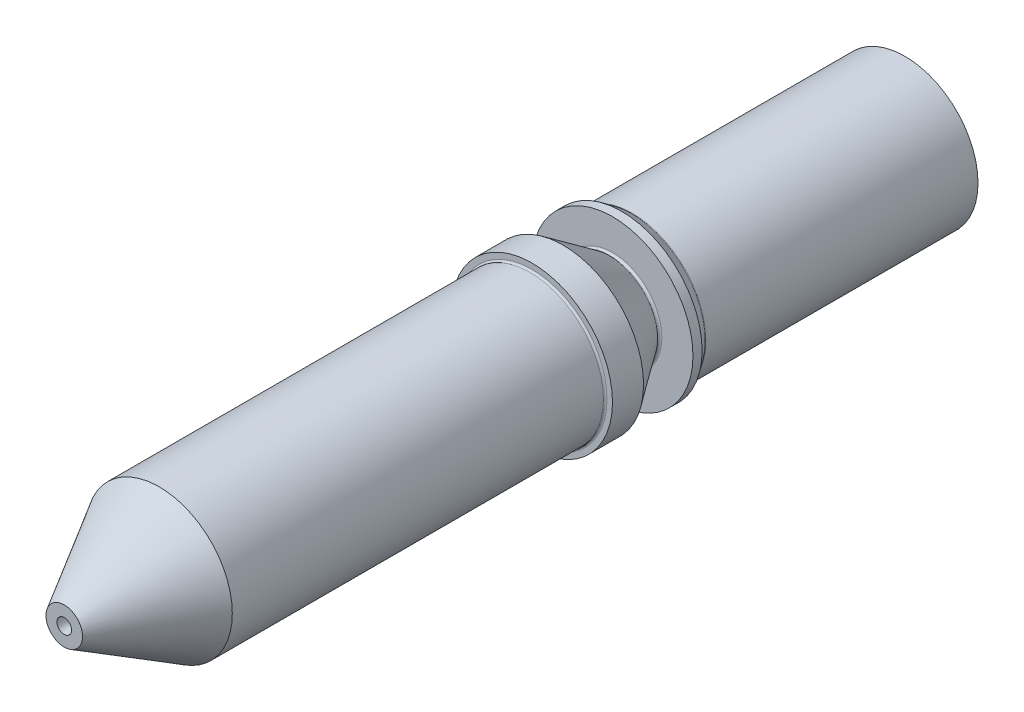
ISO-10303-21;
HEADER;
FILE_DESCRIPTION(('STEP AP214'),'2;1');
FILE_NAME('part.step','',(''),(''),'','','');
FILE_SCHEMA(('AUTOMOTIVE_DESIGN { 1 0 10303 214 1 1 1 1 }'));
ENDSEC;
DATA;
#1=APPLICATION_CONTEXT('core data for automotive mechanical design processes');
#2=APPLICATION_PROTOCOL_DEFINITION('international standard','automotive_design',2000,#1);
#3=PRODUCT_CONTEXT('',#1,'mechanical');
#4=PRODUCT('Part','Part','',(#3));
#5=PRODUCT_RELATED_PRODUCT_CATEGORY('part','',(#4));
#6=PRODUCT_DEFINITION_FORMATION('','',#4);
#7=PRODUCT_DEFINITION_CONTEXT('part definition',#1,'design');
#8=PRODUCT_DEFINITION('design','',#6,#7);
#9=PRODUCT_DEFINITION_SHAPE('','',#8);
#10=(LENGTH_UNIT() NAMED_UNIT(*) SI_UNIT(.MILLI.,.METRE.));
#11=(NAMED_UNIT(*) PLANE_ANGLE_UNIT() SI_UNIT($,.RADIAN.));
#12=(NAMED_UNIT(*) SI_UNIT($,.STERADIAN.) SOLID_ANGLE_UNIT());
#13=UNCERTAINTY_MEASURE_WITH_UNIT(LENGTH_MEASURE(1.E-05),#10,'distance_accuracy_value','');
#14=(GEOMETRIC_REPRESENTATION_CONTEXT(3) GLOBAL_UNCERTAINTY_ASSIGNED_CONTEXT((#13)) GLOBAL_UNIT_ASSIGNED_CONTEXT((#10,
#11,#12)) REPRESENTATION_CONTEXT('',''));
#15=CARTESIAN_POINT('',(0.,0.,0.));
#16=DIRECTION('',(0.,0.,1.));
#17=DIRECTION('',(1.,0.,0.));
#18=AXIS2_PLACEMENT_3D('',#15,#16,#17);
#19=CARTESIAN_POINT('',(0.200000000000003,0.,23.));
#20=DIRECTION('',(0.,0.,1.));
#21=DIRECTION('',(1.,0.,0.));
#22=AXIS2_PLACEMENT_3D('',#19,#20,#21);
#23=PLANE('',#22);
#24=CARTESIAN_POINT('',(0.,0.,23.));
#25=DIRECTION('',(0.,0.,1.));
#26=DIRECTION('',(1.,0.,0.));
#27=AXIS2_PLACEMENT_3D('',#24,#25,#26);
#28=CIRCLE('',#27,0.500000000000003);
#29=CARTESIAN_POINT('',(0.500000000000003,0.,23.));
#30=VERTEX_POINT('',#29);
#31=EDGE_CURVE('E98',#30,#30,#28,.T.);
#32=ORIENTED_EDGE('',*,*,#31,.T.);
#33=EDGE_LOOP('',(#32));
#34=FACE_BOUND('',#33,.T.);
#35=CARTESIAN_POINT('',(0.,0.,23.));
#36=DIRECTION('',(0.,0.,1.));
#37=DIRECTION('',(1.,0.,0.));
#38=AXIS2_PLACEMENT_3D('',#35,#36,#37);
#39=CIRCLE('',#38,0.200000000000003);
#40=CARTESIAN_POINT('',(0.200000000000003,0.,23.));
#41=VERTEX_POINT('',#40);
#42=EDGE_CURVE('E10',#41,#41,#39,.T.);
#43=ORIENTED_EDGE('',*,*,#42,.F.);
#44=EDGE_LOOP('',(#43));
#45=FACE_BOUND('',#44,.T.);
#46=ADVANCED_FACE('F37',(#34,#45),#23,.T.);
#47=CARTESIAN_POINT('',(0.,0.,0.));
#48=DIRECTION('',(0.,0.,1.));
#49=DIRECTION('',(1.,0.,0.));
#50=AXIS2_PLACEMENT_3D('',#47,#48,#49);
#51=CYLINDRICAL_SURFACE('',#50,0.200000000000003);
#52=ORIENTED_EDGE('',*,*,#42,.T.);
#53=EDGE_LOOP('',(#52));
#54=FACE_BOUND('',#53,.T.);
#55=CARTESIAN_POINT('',(0.,0.,22.6));
#56=DIRECTION('',(0.,0.,1.));
#57=DIRECTION('',(1.,0.,0.));
#58=AXIS2_PLACEMENT_3D('',#55,#56,#57);
#59=CIRCLE('',#58,0.200000000000003);
#60=CARTESIAN_POINT('',(0.200000000000003,0.,22.6));
#61=VERTEX_POINT('',#60);
#62=EDGE_CURVE('E43',#61,#61,#59,.T.);
#63=ORIENTED_EDGE('',*,*,#62,.F.);
#64=EDGE_LOOP('',(#63));
#65=FACE_BOUND('',#64,.T.);
#66=ADVANCED_FACE('F116',(#54,#65),#51,.F.);
#67=CARTESIAN_POINT('',(0.,0.,22.4197418142932));
#68=DIRECTION('',(0.,0.,-1.));
#69=DIRECTION('',(-1.,0.,0.));
#70=AXIS2_PLACEMENT_3D('',#67,#68,#69);
#71=CONICAL_SURFACE('',#70,0.500000000000003,1.02974425868013);
#72=ORIENTED_EDGE('',*,*,#62,.T.);
#73=EDGE_LOOP('',(#72));
#74=FACE_BOUND('',#73,.T.);
#75=CARTESIAN_POINT('',(0.,0.,22.4197418142932));
#76=DIRECTION('',(0.,0.,1.));
#77=DIRECTION('',(1.,0.,0.));
#78=AXIS2_PLACEMENT_3D('',#75,#76,#77);
#79=CIRCLE('',#78,0.500000000000003);
#80=CARTESIAN_POINT('',(0.500000000000003,0.,22.4197418142932));
#81=VERTEX_POINT('',#80);
#82=EDGE_CURVE('E47',#81,#81,#79,.T.);
#83=ORIENTED_EDGE('',*,*,#82,.F.);
#84=EDGE_LOOP('',(#83));
#85=FACE_BOUND('',#84,.T.);
#86=ADVANCED_FACE('F120',(#74,#85),#71,.F.);
#87=CARTESIAN_POINT('',(0.,0.,0.));
#88=DIRECTION('',(0.,0.,1.));
#89=DIRECTION('',(1.,0.,0.));
#90=AXIS2_PLACEMENT_3D('',#87,#88,#89);
#91=CYLINDRICAL_SURFACE('',#90,0.500000000000003);
#92=ORIENTED_EDGE('',*,*,#82,.T.);
#93=EDGE_LOOP('',(#92));
#94=FACE_BOUND('',#93,.T.);
#95=CARTESIAN_POINT('',(0.,0.,21.8));
#96=DIRECTION('',(0.,0.,1.));
#97=DIRECTION('',(1.,0.,0.));
#98=AXIS2_PLACEMENT_3D('',#95,#96,#97);
#99=CIRCLE('',#98,0.500000000000003);
#100=CARTESIAN_POINT('',(0.500000000000003,0.,21.8));
#101=VERTEX_POINT('',#100);
#102=EDGE_CURVE('E51',#101,#101,#99,.T.);
#103=ORIENTED_EDGE('',*,*,#102,.F.);
#104=EDGE_LOOP('',(#103));
#105=FACE_BOUND('',#104,.T.);
#106=ADVANCED_FACE('F124',(#94,#105),#91,.F.);
#107=CARTESIAN_POINT('',(0.,0.,21.4995696904864));
#108=DIRECTION('',(0.,0.,-1.));
#109=DIRECTION('',(-1.,0.,0.));
#110=AXIS2_PLACEMENT_3D('',#107,#108,#109);
#111=CONICAL_SURFACE('',#110,1.00000000000365,1.02974425868013);
#112=ORIENTED_EDGE('',*,*,#102,.T.);
#113=EDGE_LOOP('',(#112));
#114=FACE_BOUND('',#113,.T.);
#115=CARTESIAN_POINT('',(0.,0.,21.4995696904864));
#116=DIRECTION('',(0.,0.,1.));
#117=DIRECTION('',(1.,0.,0.));
#118=AXIS2_PLACEMENT_3D('',#115,#116,#117);
#119=CIRCLE('',#118,1.00000000000365);
#120=CARTESIAN_POINT('',(1.00000000000365,0.,21.4995696904864));
#121=VERTEX_POINT('',#120);
#122=EDGE_CURVE('E56',#121,#121,#119,.T.);
#123=ORIENTED_EDGE('',*,*,#122,.F.);
#124=EDGE_LOOP('',(#123));
#125=FACE_BOUND('',#124,.T.);
#126=ADVANCED_FACE('F130',(#114,#125),#111,.F.);
#127=CARTESIAN_POINT('',(0.,0.,0.));
#128=DIRECTION('',(0.,0.,1.));
#129=DIRECTION('',(1.,0.,0.));
#130=AXIS2_PLACEMENT_3D('',#127,#128,#129);
#131=CYLINDRICAL_SURFACE('',#130,1.00000000000365);
#132=ORIENTED_EDGE('',*,*,#122,.T.);
#133=EDGE_LOOP('',(#132));
#134=FACE_BOUND('',#133,.T.);
#135=CARTESIAN_POINT('',(0.,0.,0.));
#136=DIRECTION('',(0.,0.,1.));
#137=DIRECTION('',(1.,0.,0.));
#138=AXIS2_PLACEMENT_3D('',#135,#136,#137);
#139=CIRCLE('',#138,1.00000000000364);
#140=CARTESIAN_POINT('',(1.00000000000364,0.,0.));
#141=VERTEX_POINT('',#140);
#142=EDGE_CURVE('E59',#141,#141,#139,.T.);
#143=ORIENTED_EDGE('',*,*,#142,.F.);
#144=EDGE_LOOP('',(#143));
#145=FACE_BOUND('',#144,.T.);
#146=ADVANCED_FACE('F134',(#134,#145),#131,.F.);
#147=CARTESIAN_POINT('',(1.00000000000364,0.,0.));
#148=DIRECTION('',(0.,0.,-1.));
#149=DIRECTION('',(-1.,0.,0.));
#150=AXIS2_PLACEMENT_3D('',#147,#148,#149);
#151=PLANE('',#150);
#152=ORIENTED_EDGE('',*,*,#142,.T.);
#153=EDGE_LOOP('',(#152));
#154=FACE_BOUND('',#153,.T.);
#155=CARTESIAN_POINT('',(0.,0.,0.));
#156=DIRECTION('',(0.,0.,1.));
#157=DIRECTION('',(1.,0.,0.));
#158=AXIS2_PLACEMENT_3D('',#155,#156,#157);
#159=CIRCLE('',#158,1.99999999999773);
#160=CARTESIAN_POINT('',(1.99999999999773,0.,0.));
#161=VERTEX_POINT('',#160);
#162=EDGE_CURVE('E62',#161,#161,#159,.T.);
#163=ORIENTED_EDGE('',*,*,#162,.F.);
#164=EDGE_LOOP('',(#163));
#165=FACE_BOUND('',#164,.T.);
#166=ADVANCED_FACE('F138',(#154,#165),#151,.T.);
#167=CARTESIAN_POINT('',(0.,0.,0.));
#168=DIRECTION('',(0.,0.,1.));
#169=DIRECTION('',(1.,0.,0.));
#170=AXIS2_PLACEMENT_3D('',#167,#168,#169);
#171=CYLINDRICAL_SURFACE('',#170,1.99999999999773);
#172=ORIENTED_EDGE('',*,*,#162,.T.);
#173=EDGE_LOOP('',(#172));
#174=FACE_BOUND('',#173,.T.);
#175=CARTESIAN_POINT('',(0.,0.,7.44731453067291));
#176=DIRECTION('',(0.,0.,1.));
#177=DIRECTION('',(1.,0.,0.));
#178=AXIS2_PLACEMENT_3D('',#175,#176,#177);
#179=CIRCLE('',#178,1.99999999999773);
#180=CARTESIAN_POINT('',(1.99999999999773,0.,7.44731453067291));
#181=VERTEX_POINT('',#180);
#182=EDGE_CURVE('E65',#181,#181,#179,.T.);
#183=ORIENTED_EDGE('',*,*,#182,.F.);
#184=EDGE_LOOP('',(#183));
#185=FACE_BOUND('',#184,.T.);
#186=ADVANCED_FACE('F142',(#174,#185),#171,.T.);
#187=CARTESIAN_POINT('',(0.,0.,7.44731453067291));
#188=DIRECTION('',(0.,0.,1.));
#189=DIRECTION('',(1.,0.,0.));
#190=AXIS2_PLACEMENT_3D('',#187,#188,#189);
#191=TOROIDAL_SURFACE('',#190,2.04999999999773,0.0500000000000012);
#192=ORIENTED_EDGE('',*,*,#182,.T.);
#193=EDGE_LOOP('',(#192));
#194=FACE_BOUND('',#193,.T.);
#195=CARTESIAN_POINT('',(0.,0.,7.47599335249116));
#196=DIRECTION('',(0.,0.,1.));
#197=DIRECTION('',(1.,0.,0.));
#198=AXIS2_PLACEMENT_3D('',#195,#196,#197);
#199=CIRCLE('',#198,2.00904239778377);
#200=CARTESIAN_POINT('',(2.00904239778377,0.,7.47599335249116));
#201=VERTEX_POINT('',#200);
#202=EDGE_CURVE('E68',#201,#201,#199,.T.);
#203=ORIENTED_EDGE('',*,*,#202,.F.);
#204=EDGE_LOOP('',(#203));
#205=FACE_BOUND('',#204,.T.);
#206=ADVANCED_FACE('F146',(#194,#205),#191,.F.);
#207=CARTESIAN_POINT('',(0.,0.,7.74870907145865));
#208=DIRECTION('',(0.,0.,1.));
#209=DIRECTION('',(1.,0.,0.));
#210=AXIS2_PLACEMENT_3D('',#207,#208,#209);
#211=CONICAL_SURFACE('',#210,2.2,0.610865238215021);
#212=ORIENTED_EDGE('',*,*,#202,.T.);
#213=EDGE_LOOP('',(#212));
#214=FACE_BOUND('',#213,.T.);
#215=CARTESIAN_POINT('',(0.,0.,7.74870907145865));
#216=DIRECTION('',(0.,0.,1.));
#217=DIRECTION('',(1.,0.,0.));
#218=AXIS2_PLACEMENT_3D('',#215,#216,#217);
#219=CIRCLE('',#218,2.2);
#220=CARTESIAN_POINT('',(2.2,0.,7.74870907145865));
#221=VERTEX_POINT('',#220);
#222=EDGE_CURVE('E71',#221,#221,#219,.T.);
#223=ORIENTED_EDGE('',*,*,#222,.F.);
#224=EDGE_LOOP('',(#223));
#225=FACE_BOUND('',#224,.T.);
#226=ADVANCED_FACE('F150',(#214,#225),#211,.T.);
#227=CARTESIAN_POINT('',(0.,0.,0.));
#228=DIRECTION('',(0.,0.,1.));
#229=DIRECTION('',(1.,0.,0.));
#230=AXIS2_PLACEMENT_3D('',#227,#228,#229);
#231=CYLINDRICAL_SURFACE('',#230,2.2);
#232=ORIENTED_EDGE('',*,*,#222,.T.);
#233=EDGE_LOOP('',(#232));
#234=FACE_BOUND('',#233,.T.);
#235=CARTESIAN_POINT('',(0.,0.,7.99870907145865));
#236=DIRECTION('',(0.,0.,1.));
#237=DIRECTION('',(1.,0.,0.));
#238=AXIS2_PLACEMENT_3D('',#235,#236,#237);
#239=CIRCLE('',#238,2.2);
#240=CARTESIAN_POINT('',(2.2,0.,7.99870907145865));
#241=VERTEX_POINT('',#240);
#242=EDGE_CURVE('E74',#241,#241,#239,.T.);
#243=ORIENTED_EDGE('',*,*,#242,.F.);
#244=EDGE_LOOP('',(#243));
#245=FACE_BOUND('',#244,.T.);
#246=ADVANCED_FACE('F154',(#234,#245),#231,.T.);
#247=CARTESIAN_POINT('',(1.35,0.,7.99870907145865));
#248=DIRECTION('',(0.,0.,1.));
#249=DIRECTION('',(1.,0.,0.));
#250=AXIS2_PLACEMENT_3D('',#247,#248,#249);
#251=PLANE('',#250);
#252=ORIENTED_EDGE('',*,*,#242,.T.);
#253=EDGE_LOOP('',(#252));
#254=FACE_BOUND('',#253,.T.);
#255=CARTESIAN_POINT('',(0.,0.,7.99870907145865));
#256=DIRECTION('',(0.,0.,1.));
#257=DIRECTION('',(1.,0.,0.));
#258=AXIS2_PLACEMENT_3D('',#255,#256,#257);
#259=CIRCLE('',#258,1.35);
#260=CARTESIAN_POINT('',(1.35,0.,7.99870907145865));
#261=VERTEX_POINT('',#260);
#262=EDGE_CURVE('E77',#261,#261,#259,.T.);
#263=ORIENTED_EDGE('',*,*,#262,.F.);
#264=EDGE_LOOP('',(#263));
#265=FACE_BOUND('',#264,.T.);
#266=ADVANCED_FACE('F158',(#254,#265),#251,.T.);
#267=CARTESIAN_POINT('',(0.,0.,8.04870907145866));
#268=DIRECTION('',(0.,0.,1.));
#269=DIRECTION('',(1.,0.,0.));
#270=AXIS2_PLACEMENT_3D('',#267,#268,#269);
#271=TOROIDAL_SURFACE('',#270,1.35,0.0500000000000014);
#272=ORIENTED_EDGE('',*,*,#262,.T.);
#273=EDGE_LOOP('',(#272));
#274=FACE_BOUND('',#273,.T.);
#275=CARTESIAN_POINT('',(0.,0.,8.07738789327691));
#276=DIRECTION('',(0.,0.,1.));
#277=DIRECTION('',(1.,0.,0.));
#278=AXIS2_PLACEMENT_3D('',#275,#276,#277);
#279=CIRCLE('',#278,1.30904239778604);
#280=CARTESIAN_POINT('',(1.30904239778604,0.,8.07738789327691));
#281=VERTEX_POINT('',#280);
#282=EDGE_CURVE('E80',#281,#281,#279,.T.);
#283=ORIENTED_EDGE('',*,*,#282,.F.);
#284=EDGE_LOOP('',(#283));
#285=FACE_BOUND('',#284,.T.);
#286=ADVANCED_FACE('F162',(#274,#285),#271,.F.);
#287=CARTESIAN_POINT('',(0.,0.,9.34980721692446));
#288=DIRECTION('',(0.,0.,1.));
#289=DIRECTION('',(1.,0.,0.));
#290=AXIS2_PLACEMENT_3D('',#287,#288,#289);
#291=CONICAL_SURFACE('',#290,2.2,0.61086523821502);
#292=ORIENTED_EDGE('',*,*,#282,.T.);
#293=EDGE_LOOP('',(#292));
#294=FACE_BOUND('',#293,.T.);
#295=CARTESIAN_POINT('',(0.,0.,9.34980721692446));
#296=DIRECTION('',(0.,0.,1.));
#297=DIRECTION('',(1.,0.,0.));
#298=AXIS2_PLACEMENT_3D('',#295,#296,#297);
#299=CIRCLE('',#298,2.2);
#300=CARTESIAN_POINT('',(2.2,0.,9.34980721692446));
#301=VERTEX_POINT('',#300);
#302=EDGE_CURVE('E83',#301,#301,#299,.T.);
#303=ORIENTED_EDGE('',*,*,#302,.F.);
#304=EDGE_LOOP('',(#303));
#305=FACE_BOUND('',#304,.T.);
#306=ADVANCED_FACE('F166',(#294,#305),#291,.T.);
#307=CARTESIAN_POINT('',(0.,0.,0.));
#308=DIRECTION('',(0.,0.,1.));
#309=DIRECTION('',(1.,0.,0.));
#310=AXIS2_PLACEMENT_3D('',#307,#308,#309);
#311=CYLINDRICAL_SURFACE('',#310,2.2);
#312=ORIENTED_EDGE('',*,*,#302,.T.);
#313=EDGE_LOOP('',(#312));
#314=FACE_BOUND('',#313,.T.);
#315=CARTESIAN_POINT('',(0.,0.,10.2));
#316=DIRECTION('',(0.,0.,1.));
#317=DIRECTION('',(1.,0.,0.));
#318=AXIS2_PLACEMENT_3D('',#315,#316,#317);
#319=CIRCLE('',#318,2.2);
#320=CARTESIAN_POINT('',(2.2,0.,10.2));
#321=VERTEX_POINT('',#320);
#322=EDGE_CURVE('E86',#321,#321,#319,.T.);
#323=ORIENTED_EDGE('',*,*,#322,.F.);
#324=EDGE_LOOP('',(#323));
#325=FACE_BOUND('',#324,.T.);
#326=ADVANCED_FACE('F170',(#314,#325),#311,.T.);
#327=CARTESIAN_POINT('',(2.04999999999773,0.,10.2));
#328=DIRECTION('',(0.,0.,1.));
#329=DIRECTION('',(1.,0.,0.));
#330=AXIS2_PLACEMENT_3D('',#327,#328,#329);
#331=PLANE('',#330);
#332=ORIENTED_EDGE('',*,*,#322,.T.);
#333=EDGE_LOOP('',(#332));
#334=FACE_BOUND('',#333,.T.);
#335=CARTESIAN_POINT('',(0.,0.,10.2));
#336=DIRECTION('',(0.,0.,1.));
#337=DIRECTION('',(1.,0.,0.));
#338=AXIS2_PLACEMENT_3D('',#335,#336,#337);
#339=CIRCLE('',#338,2.04999999999773);
#340=CARTESIAN_POINT('',(2.04999999999773,0.,10.2));
#341=VERTEX_POINT('',#340);
#342=EDGE_CURVE('E89',#341,#341,#339,.T.);
#343=ORIENTED_EDGE('',*,*,#342,.F.);
#344=EDGE_LOOP('',(#343));
#345=FACE_BOUND('',#344,.T.);
#346=ADVANCED_FACE('F174',(#334,#345),#331,.T.);
#347=CARTESIAN_POINT('',(0.,0.,10.25));
#348=DIRECTION('',(0.,0.,1.));
#349=DIRECTION('',(1.,0.,0.));
#350=AXIS2_PLACEMENT_3D('',#347,#348,#349);
#351=TOROIDAL_SURFACE('',#350,2.04999999999773,0.0500000000000016);
#352=ORIENTED_EDGE('',*,*,#342,.T.);
#353=EDGE_LOOP('',(#352));
#354=FACE_BOUND('',#353,.T.);
#355=CARTESIAN_POINT('',(0.,0.,10.25));
#356=DIRECTION('',(0.,0.,1.));
#357=DIRECTION('',(1.,0.,0.));
#358=AXIS2_PLACEMENT_3D('',#355,#356,#357);
#359=CIRCLE('',#358,1.99999999999773);
#360=CARTESIAN_POINT('',(1.99999999999773,0.,10.25));
#361=VERTEX_POINT('',#360);
#362=EDGE_CURVE('E92',#361,#361,#359,.T.);
#363=ORIENTED_EDGE('',*,*,#362,.F.);
#364=EDGE_LOOP('',(#363));
#365=FACE_BOUND('',#364,.T.);
#366=ADVANCED_FACE('F112',(#354,#365),#351,.F.);
#367=CARTESIAN_POINT('',(0.,0.,0.));
#368=DIRECTION('',(0.,0.,1.));
#369=DIRECTION('',(1.,0.,0.));
#370=AXIS2_PLACEMENT_3D('',#367,#368,#369);
#371=CYLINDRICAL_SURFACE('',#370,1.99999999999773);
#372=ORIENTED_EDGE('',*,*,#362,.T.);
#373=EDGE_LOOP('',(#372));
#374=FACE_BOUND('',#373,.T.);
#375=CARTESIAN_POINT('',(0.,0.,20.4019237886506));
#376=DIRECTION('',(0.,0.,1.));
#377=DIRECTION('',(1.,0.,0.));
#378=AXIS2_PLACEMENT_3D('',#375,#376,#377);
#379=CIRCLE('',#378,1.99999999999773);
#380=CARTESIAN_POINT('',(1.99999999999773,0.,20.4019237886506));
#381=VERTEX_POINT('',#380);
#382=EDGE_CURVE('E95',#381,#381,#379,.T.);
#383=ORIENTED_EDGE('',*,*,#382,.F.);
#384=EDGE_LOOP('',(#383));
#385=FACE_BOUND('',#384,.T.);
#386=ADVANCED_FACE('F106',(#374,#385),#371,.T.);
#387=CARTESIAN_POINT('',(0.,0.,23.));
#388=DIRECTION('',(0.,0.,-1.));
#389=DIRECTION('',(-1.,0.,0.));
#390=AXIS2_PLACEMENT_3D('',#387,#388,#389);
#391=CONICAL_SURFACE('',#390,0.500000000000003,0.523598775598296);
#392=ORIENTED_EDGE('',*,*,#382,.T.);
#393=EDGE_LOOP('',(#392));
#394=FACE_BOUND('',#393,.T.);
#395=ORIENTED_EDGE('',*,*,#31,.F.);
#396=EDGE_LOOP('',(#395));
#397=FACE_BOUND('',#396,.T.);
#398=ADVANCED_FACE('F104',(#394,#397),#391,.T.);
#399=CLOSED_SHELL('',(#46,#66,#86,#106,#126,#146,#166,#186,#206,#226,#246,#266,#286,#306,#326,
#346,#366,#386,#398));
#400=MANIFOLD_SOLID_BREP('B2',#399);
#401=ADVANCED_BREP_SHAPE_REPRESENTATION('',(#18,#400),#14);
#402=SHAPE_DEFINITION_REPRESENTATION(#9,#401);
ENDSEC;
END-ISO-10303-21;
